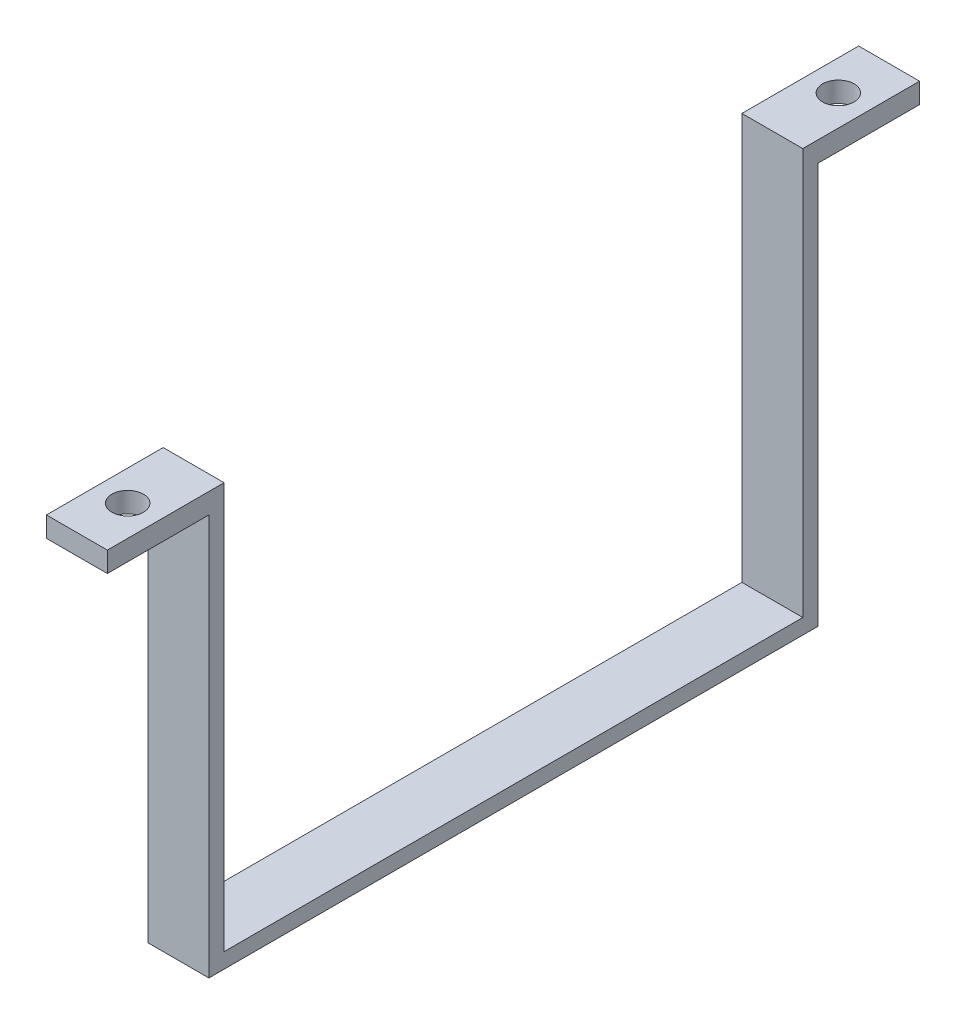
ISO-10303-21;
HEADER;
FILE_DESCRIPTION(('STEP AP214'),'2;1');
FILE_NAME('part.step','',(''),(''),'','','');
FILE_SCHEMA(('AUTOMOTIVE_DESIGN { 1 0 10303 214 1 1 1 1 }'));
ENDSEC;
DATA;
#1=APPLICATION_CONTEXT('core data for automotive mechanical design processes');
#2=APPLICATION_PROTOCOL_DEFINITION('international standard','automotive_design',2000,#1);
#3=PRODUCT_CONTEXT('',#1,'mechanical');
#4=PRODUCT('Part','Part','',(#3));
#5=PRODUCT_RELATED_PRODUCT_CATEGORY('part','',(#4));
#6=PRODUCT_DEFINITION_FORMATION('','',#4);
#7=PRODUCT_DEFINITION_CONTEXT('part definition',#1,'design');
#8=PRODUCT_DEFINITION('design','',#6,#7);
#9=PRODUCT_DEFINITION_SHAPE('','',#8);
#10=(LENGTH_UNIT() NAMED_UNIT(*) SI_UNIT(.MILLI.,.METRE.));
#11=(NAMED_UNIT(*) PLANE_ANGLE_UNIT() SI_UNIT($,.RADIAN.));
#12=(NAMED_UNIT(*) SI_UNIT($,.STERADIAN.) SOLID_ANGLE_UNIT());
#13=UNCERTAINTY_MEASURE_WITH_UNIT(LENGTH_MEASURE(1.E-05),#10,'distance_accuracy_value','');
#14=(GEOMETRIC_REPRESENTATION_CONTEXT(3) GLOBAL_UNCERTAINTY_ASSIGNED_CONTEXT((#13)) GLOBAL_UNIT_ASSIGNED_CONTEXT((#10,
#11,#12)) REPRESENTATION_CONTEXT('',''));
#15=CARTESIAN_POINT('',(0.,0.,0.));
#16=DIRECTION('',(0.,0.,1.));
#17=DIRECTION('',(1.,0.,0.));
#18=AXIS2_PLACEMENT_3D('',#15,#16,#17);
#19=CARTESIAN_POINT('',(0.,40.,-30.));
#20=DIRECTION('',(0.,0.,-1.));
#21=DIRECTION('',(-1.,0.,0.));
#22=AXIS2_PLACEMENT_3D('',#19,#20,#21);
#23=PLANE('',#22);
#24=DIRECTION('',(1.,0.,0.));
#25=VECTOR('',#24,1.);
#26=CARTESIAN_POINT('',(-25.,38.,-30.));
#27=LINE('',#26,#25);
#28=CARTESIAN_POINT('',(-23.,38.,-30.));
#29=VERTEX_POINT('',#28);
#30=CARTESIAN_POINT('',(-17.,38.,-30.));
#31=VERTEX_POINT('',#30);
#32=EDGE_CURVE('E154',#29,#31,#27,.T.);
#33=ORIENTED_EDGE('',*,*,#32,.T.);
#34=DIRECTION('',(0.,-1.,0.));
#35=VECTOR('',#34,1.);
#36=CARTESIAN_POINT('',(-17.,40.,-30.));
#37=LINE('',#36,#35);
#38=CARTESIAN_POINT('',(-17.,-1.5,-30.));
#39=VERTEX_POINT('',#38);
#40=EDGE_CURVE('E64',#31,#39,#37,.T.);
#41=ORIENTED_EDGE('',*,*,#40,.T.);
#42=DIRECTION('',(1.,0.,0.));
#43=VECTOR('',#42,1.);
#44=CARTESIAN_POINT('',(-25.,-1.5,-30.));
#45=LINE('',#44,#43);
#46=CARTESIAN_POINT('',(-23.,-1.5,-30.));
#47=VERTEX_POINT('',#46);
#48=EDGE_CURVE('E168',#47,#39,#45,.T.);
#49=ORIENTED_EDGE('',*,*,#48,.F.);
#50=DIRECTION('',(0.,1.,0.));
#51=VECTOR('',#50,1.);
#52=CARTESIAN_POINT('',(-23.,40.,-30.));
#53=LINE('',#52,#51);
#54=EDGE_CURVE('E256',#47,#29,#53,.T.);
#55=ORIENTED_EDGE('',*,*,#54,.T.);
#56=EDGE_LOOP('',(#33,#41,#49,#55));
#57=FACE_BOUND('',#56,.T.);
#58=ADVANCED_FACE('F48',(#57),#23,.T.);
#59=CARTESIAN_POINT('',(0.,40.,30.));
#60=DIRECTION('',(0.,0.,-1.));
#61=DIRECTION('',(-1.,0.,0.));
#62=AXIS2_PLACEMENT_3D('',#59,#60,#61);
#63=PLANE('',#62);
#64=DIRECTION('',(0.,-1.,0.));
#65=VECTOR('',#64,1.);
#66=CARTESIAN_POINT('',(-17.,40.,30.));
#67=LINE('',#66,#65);
#68=CARTESIAN_POINT('',(-17.,38.,30.));
#69=VERTEX_POINT('',#68);
#70=CARTESIAN_POINT('',(-17.,-1.5,30.));
#71=VERTEX_POINT('',#70);
#72=EDGE_CURVE('E229',#69,#71,#67,.T.);
#73=ORIENTED_EDGE('',*,*,#72,.F.);
#74=DIRECTION('',(1.,0.,0.));
#75=VECTOR('',#74,1.);
#76=CARTESIAN_POINT('',(-25.,38.,30.));
#77=LINE('',#76,#75);
#78=CARTESIAN_POINT('',(-23.,38.,30.));
#79=VERTEX_POINT('',#78);
#80=EDGE_CURVE('E164',#79,#69,#77,.T.);
#81=ORIENTED_EDGE('',*,*,#80,.F.);
#82=DIRECTION('',(0.,1.,0.));
#83=VECTOR('',#82,1.);
#84=CARTESIAN_POINT('',(-23.,40.,30.));
#85=LINE('',#84,#83);
#86=CARTESIAN_POINT('',(-23.,-1.5,30.));
#87=VERTEX_POINT('',#86);
#88=EDGE_CURVE('E228',#87,#79,#85,.T.);
#89=ORIENTED_EDGE('',*,*,#88,.F.);
#90=DIRECTION('',(-1.,0.,0.));
#91=VECTOR('',#90,1.);
#92=CARTESIAN_POINT('',(-25.,-1.5,30.));
#93=LINE('',#92,#91);
#94=EDGE_CURVE('E179',#71,#87,#93,.T.);
#95=ORIENTED_EDGE('',*,*,#94,.F.);
#96=EDGE_LOOP('',(#73,#81,#89,#95));
#97=FACE_BOUND('',#96,.T.);
#98=ADVANCED_FACE('F226',(#97),#63,.F.);
#99=CARTESIAN_POINT('',(0.,40.,28.5));
#100=DIRECTION('',(0.,0.,-1.));
#101=DIRECTION('',(-1.,0.,0.));
#102=AXIS2_PLACEMENT_3D('',#99,#100,#101);
#103=PLANE('',#102);
#104=DIRECTION('',(1.,0.,0.));
#105=VECTOR('',#104,1.);
#106=CARTESIAN_POINT('',(0.,40.,28.5));
#107=LINE('',#106,#105);
#108=CARTESIAN_POINT('',(-23.,40.,28.5));
#109=VERTEX_POINT('',#108);
#110=CARTESIAN_POINT('',(-17.,40.,28.5));
#111=VERTEX_POINT('',#110);
#112=EDGE_CURVE('E183',#109,#111,#107,.T.);
#113=ORIENTED_EDGE('',*,*,#112,.T.);
#114=DIRECTION('',(0.,-1.,0.));
#115=VECTOR('',#114,1.);
#116=CARTESIAN_POINT('',(-17.,40.,28.5));
#117=LINE('',#116,#115);
#118=CARTESIAN_POINT('',(-17.,0.,28.5));
#119=VERTEX_POINT('',#118);
#120=EDGE_CURVE('E232',#111,#119,#117,.T.);
#121=ORIENTED_EDGE('',*,*,#120,.T.);
#122=DIRECTION('',(1.,0.,0.));
#123=VECTOR('',#122,1.);
#124=CARTESIAN_POINT('',(0.,0.,28.5));
#125=LINE('',#124,#123);
#126=CARTESIAN_POINT('',(-23.,0.,28.5));
#127=VERTEX_POINT('',#126);
#128=EDGE_CURVE('E182',#127,#119,#125,.T.);
#129=ORIENTED_EDGE('',*,*,#128,.F.);
#130=DIRECTION('',(0.,1.,0.));
#131=VECTOR('',#130,1.);
#132=CARTESIAN_POINT('',(-23.,40.,28.5));
#133=LINE('',#132,#131);
#134=EDGE_CURVE('E274',#127,#109,#133,.T.);
#135=ORIENTED_EDGE('',*,*,#134,.T.);
#136=EDGE_LOOP('',(#113,#121,#129,#135));
#137=FACE_BOUND('',#136,.T.);
#138=ADVANCED_FACE('F50',(#137),#103,.T.);
#139=CARTESIAN_POINT('',(0.,40.,-28.5));
#140=DIRECTION('',(0.,0.,-1.));
#141=DIRECTION('',(-1.,0.,0.));
#142=AXIS2_PLACEMENT_3D('',#139,#140,#141);
#143=PLANE('',#142);
#144=DIRECTION('',(0.,-1.,0.));
#145=VECTOR('',#144,1.);
#146=CARTESIAN_POINT('',(-17.,40.,-28.5));
#147=LINE('',#146,#145);
#148=CARTESIAN_POINT('',(-17.,40.,-28.5));
#149=VERTEX_POINT('',#148);
#150=CARTESIAN_POINT('',(-17.,0.,-28.5));
#151=VERTEX_POINT('',#150);
#152=EDGE_CURVE('E300',#149,#151,#147,.T.);
#153=ORIENTED_EDGE('',*,*,#152,.F.);
#154=DIRECTION('',(1.,0.,0.));
#155=VECTOR('',#154,1.);
#156=CARTESIAN_POINT('',(0.,40.,-28.5));
#157=LINE('',#156,#155);
#158=CARTESIAN_POINT('',(-23.,40.,-28.5));
#159=VERTEX_POINT('',#158);
#160=EDGE_CURVE('E187',#159,#149,#157,.T.);
#161=ORIENTED_EDGE('',*,*,#160,.F.);
#162=DIRECTION('',(0.,1.,0.));
#163=VECTOR('',#162,1.);
#164=CARTESIAN_POINT('',(-23.,40.,-28.5));
#165=LINE('',#164,#163);
#166=CARTESIAN_POINT('',(-23.,0.,-28.5));
#167=VERTEX_POINT('',#166);
#168=EDGE_CURVE('E271',#167,#159,#165,.T.);
#169=ORIENTED_EDGE('',*,*,#168,.F.);
#170=DIRECTION('',(1.,0.,0.));
#171=VECTOR('',#170,1.);
#172=CARTESIAN_POINT('',(0.,0.,-28.5));
#173=LINE('',#172,#171);
#174=EDGE_CURVE('E188',#167,#151,#173,.T.);
#175=ORIENTED_EDGE('',*,*,#174,.T.);
#176=EDGE_LOOP('',(#153,#161,#169,#175));
#177=FACE_BOUND('',#176,.T.);
#178=ADVANCED_FACE('F298',(#177),#143,.F.);
#179=CARTESIAN_POINT('',(0.,40.,0.));
#180=DIRECTION('',(0.,1.,0.));
#181=DIRECTION('',(0.,0.,1.));
#182=AXIS2_PLACEMENT_3D('',#179,#180,#181);
#183=PLANE('',#182);
#184=CARTESIAN_POINT('',(-20.,40.,35.));
#185=DIRECTION('',(0.,1.,0.));
#186=DIRECTION('',(0.,0.,1.));
#187=AXIS2_PLACEMENT_3D('',#184,#185,#186);
#188=CIRCLE('',#187,1.55);
#189=CARTESIAN_POINT('',(-20.,40.,36.55));
#190=VERTEX_POINT('',#189);
#191=EDGE_CURVE('E278',#190,#190,#188,.T.);
#192=ORIENTED_EDGE('',*,*,#191,.F.);
#193=EDGE_LOOP('',(#192));
#194=FACE_BOUND('',#193,.T.);
#195=DIRECTION('',(1.,0.,0.));
#196=VECTOR('',#195,1.);
#197=CARTESIAN_POINT('',(-25.,40.,40.));
#198=LINE('',#197,#196);
#199=CARTESIAN_POINT('',(-23.,40.,40.));
#200=VERTEX_POINT('',#199);
#201=CARTESIAN_POINT('',(-17.,40.,40.));
#202=VERTEX_POINT('',#201);
#203=EDGE_CURVE('E158',#200,#202,#198,.T.);
#204=ORIENTED_EDGE('',*,*,#203,.T.);
#205=DIRECTION('',(0.,0.,-1.));
#206=VECTOR('',#205,1.);
#207=CARTESIAN_POINT('',(-17.,40.,0.));
#208=LINE('',#207,#206);
#209=EDGE_CURVE('E236',#202,#111,#208,.T.);
#210=ORIENTED_EDGE('',*,*,#209,.T.);
#211=ORIENTED_EDGE('',*,*,#112,.F.);
#212=DIRECTION('',(0.,0.,-1.));
#213=VECTOR('',#212,1.);
#214=CARTESIAN_POINT('',(-23.,40.,-40.));
#215=LINE('',#214,#213);
#216=EDGE_CURVE('E253',#200,#109,#215,.T.);
#217=ORIENTED_EDGE('',*,*,#216,.F.);
#218=EDGE_LOOP('',(#204,#210,#211,#217));
#219=FACE_BOUND('',#218,.T.);
#220=ADVANCED_FACE('F291',(#194,#219),#183,.T.);
#221=CARTESIAN_POINT('',(-20.,40.,-35.));
#222=DIRECTION('',(0.,1.,0.));
#223=DIRECTION('',(0.,0.,1.));
#224=AXIS2_PLACEMENT_3D('',#221,#222,#223);
#225=CIRCLE('',#224,1.55);
#226=CARTESIAN_POINT('',(-20.,40.,-33.45));
#227=VERTEX_POINT('',#226);
#228=EDGE_CURVE('E202',#227,#227,#225,.T.);
#229=ORIENTED_EDGE('',*,*,#228,.F.);
#230=EDGE_LOOP('',(#229));
#231=FACE_BOUND('',#230,.T.);
#232=ORIENTED_EDGE('',*,*,#160,.T.);
#233=CARTESIAN_POINT('',(-17.,40.,-40.));
#234=VERTEX_POINT('',#233);
#235=EDGE_CURVE('E150',#149,#234,#208,.T.);
#236=ORIENTED_EDGE('',*,*,#235,.T.);
#237=DIRECTION('',(1.,0.,0.));
#238=VECTOR('',#237,1.);
#239=CARTESIAN_POINT('',(-25.,40.,-40.));
#240=LINE('',#239,#238);
#241=CARTESIAN_POINT('',(-23.,40.,-40.));
#242=VERTEX_POINT('',#241);
#243=EDGE_CURVE('E148',#242,#234,#240,.T.);
#244=ORIENTED_EDGE('',*,*,#243,.F.);
#245=EDGE_CURVE('E252',#159,#242,#215,.T.);
#246=ORIENTED_EDGE('',*,*,#245,.F.);
#247=EDGE_LOOP('',(#232,#236,#244,#246));
#248=FACE_BOUND('',#247,.T.);
#249=ADVANCED_FACE('F287',(#231,#248),#183,.T.);
#250=CARTESIAN_POINT('',(0.,0.,0.));
#251=DIRECTION('',(0.,-1.,0.));
#252=DIRECTION('',(0.,0.,-1.));
#253=AXIS2_PLACEMENT_3D('',#250,#251,#252);
#254=PLANE('',#253);
#255=DIRECTION('',(0.,0.,1.));
#256=VECTOR('',#255,1.);
#257=CARTESIAN_POINT('',(-17.,0.,0.));
#258=LINE('',#257,#256);
#259=EDGE_CURVE('E239',#151,#119,#258,.T.);
#260=ORIENTED_EDGE('',*,*,#259,.F.);
#261=ORIENTED_EDGE('',*,*,#174,.F.);
#262=DIRECTION('',(0.,0.,-1.));
#263=VECTOR('',#262,1.);
#264=CARTESIAN_POINT('',(-23.,0.,0.));
#265=LINE('',#264,#263);
#266=EDGE_CURVE('E268',#127,#167,#265,.T.);
#267=ORIENTED_EDGE('',*,*,#266,.F.);
#268=ORIENTED_EDGE('',*,*,#128,.T.);
#269=EDGE_LOOP('',(#260,#261,#267,#268));
#270=FACE_BOUND('',#269,.T.);
#271=ADVANCED_FACE('F290',(#270),#254,.F.);
#272=CARTESIAN_POINT('',(0.,-1.5,0.));
#273=DIRECTION('',(0.,-1.,0.));
#274=DIRECTION('',(0.,0.,-1.));
#275=AXIS2_PLACEMENT_3D('',#272,#273,#274);
#276=PLANE('',#275);
#277=ORIENTED_EDGE('',*,*,#48,.T.);
#278=DIRECTION('',(0.,0.,1.));
#279=VECTOR('',#278,1.);
#280=CARTESIAN_POINT('',(-17.,-1.5,0.));
#281=LINE('',#280,#279);
#282=EDGE_CURVE('E306',#39,#71,#281,.T.);
#283=ORIENTED_EDGE('',*,*,#282,.T.);
#284=ORIENTED_EDGE('',*,*,#94,.T.);
#285=DIRECTION('',(0.,0.,-1.));
#286=VECTOR('',#285,1.);
#287=CARTESIAN_POINT('',(-23.,-1.5,0.));
#288=LINE('',#287,#286);
#289=EDGE_CURVE('E260',#87,#47,#288,.T.);
#290=ORIENTED_EDGE('',*,*,#289,.T.);
#291=EDGE_LOOP('',(#277,#283,#284,#290));
#292=FACE_BOUND('',#291,.T.);
#293=ADVANCED_FACE('F215',(#292),#276,.T.);
#294=CARTESIAN_POINT('',(-25.,38.,30.));
#295=DIRECTION('',(0.,-1.,0.));
#296=DIRECTION('',(0.,0.,-1.));
#297=AXIS2_PLACEMENT_3D('',#294,#295,#296);
#298=PLANE('',#297);
#299=CARTESIAN_POINT('',(-20.,38.,35.));
#300=DIRECTION('',(0.,-1.,0.));
#301=DIRECTION('',(0.,0.,-1.));
#302=AXIS2_PLACEMENT_3D('',#299,#300,#301);
#303=CIRCLE('',#302,1.55);
#304=CARTESIAN_POINT('',(-20.,38.,33.45));
#305=VERTEX_POINT('',#304);
#306=EDGE_CURVE('E160',#305,#305,#303,.T.);
#307=ORIENTED_EDGE('',*,*,#306,.F.);
#308=EDGE_LOOP('',(#307));
#309=FACE_BOUND('',#308,.T.);
#310=ORIENTED_EDGE('',*,*,#80,.T.);
#311=DIRECTION('',(0.,0.,1.));
#312=VECTOR('',#311,1.);
#313=CARTESIAN_POINT('',(-17.,38.,30.));
#314=LINE('',#313,#312);
#315=CARTESIAN_POINT('',(-17.,38.,40.));
#316=VERTEX_POINT('',#315);
#317=EDGE_CURVE('E221',#69,#316,#314,.T.);
#318=ORIENTED_EDGE('',*,*,#317,.T.);
#319=DIRECTION('',(1.,0.,0.));
#320=VECTOR('',#319,1.);
#321=CARTESIAN_POINT('',(-25.,38.,40.));
#322=LINE('',#321,#320);
#323=CARTESIAN_POINT('',(-23.,38.,40.));
#324=VERTEX_POINT('',#323);
#325=EDGE_CURVE('E169',#324,#316,#322,.T.);
#326=ORIENTED_EDGE('',*,*,#325,.F.);
#327=DIRECTION('',(0.,0.,-1.));
#328=VECTOR('',#327,1.);
#329=CARTESIAN_POINT('',(-23.,38.,30.));
#330=LINE('',#329,#328);
#331=EDGE_CURVE('E222',#324,#79,#330,.T.);
#332=ORIENTED_EDGE('',*,*,#331,.T.);
#333=EDGE_LOOP('',(#310,#318,#326,#332));
#334=FACE_BOUND('',#333,.T.);
#335=ADVANCED_FACE('F211',(#309,#334),#298,.T.);
#336=CARTESIAN_POINT('',(-25.,40.,40.));
#337=DIRECTION('',(0.,0.,1.));
#338=DIRECTION('',(1.,0.,0.));
#339=AXIS2_PLACEMENT_3D('',#336,#337,#338);
#340=PLANE('',#339);
#341=ORIENTED_EDGE('',*,*,#325,.T.);
#342=DIRECTION('',(0.,1.,0.));
#343=VECTOR('',#342,1.);
#344=CARTESIAN_POINT('',(-17.,40.,40.));
#345=LINE('',#344,#343);
#346=EDGE_CURVE('E243',#316,#202,#345,.T.);
#347=ORIENTED_EDGE('',*,*,#346,.T.);
#348=ORIENTED_EDGE('',*,*,#203,.F.);
#349=DIRECTION('',(0.,1.,0.));
#350=VECTOR('',#349,1.);
#351=CARTESIAN_POINT('',(-23.,40.,40.));
#352=LINE('',#351,#350);
#353=EDGE_CURVE('E249',#324,#200,#352,.T.);
#354=ORIENTED_EDGE('',*,*,#353,.F.);
#355=EDGE_LOOP('',(#341,#347,#348,#354));
#356=FACE_BOUND('',#355,.T.);
#357=ADVANCED_FACE('F214',(#356),#340,.T.);
#358=CARTESIAN_POINT('',(-25.,40.,-40.));
#359=DIRECTION('',(0.,0.,-1.));
#360=DIRECTION('',(-1.,0.,0.));
#361=AXIS2_PLACEMENT_3D('',#358,#359,#360);
#362=PLANE('',#361);
#363=ORIENTED_EDGE('',*,*,#243,.T.);
#364=DIRECTION('',(0.,-1.,0.));
#365=VECTOR('',#364,1.);
#366=CARTESIAN_POINT('',(-17.,40.,-40.));
#367=LINE('',#366,#365);
#368=CARTESIAN_POINT('',(-17.,38.,-40.));
#369=VERTEX_POINT('',#368);
#370=EDGE_CURVE('E136',#234,#369,#367,.T.);
#371=ORIENTED_EDGE('',*,*,#370,.T.);
#372=DIRECTION('',(1.,0.,0.));
#373=VECTOR('',#372,1.);
#374=CARTESIAN_POINT('',(-25.,38.,-40.));
#375=LINE('',#374,#373);
#376=CARTESIAN_POINT('',(-23.,38.,-40.));
#377=VERTEX_POINT('',#376);
#378=EDGE_CURVE('E146',#377,#369,#375,.T.);
#379=ORIENTED_EDGE('',*,*,#378,.F.);
#380=DIRECTION('',(0.,-1.,0.));
#381=VECTOR('',#380,1.);
#382=CARTESIAN_POINT('',(-23.,40.,-40.));
#383=LINE('',#382,#381);
#384=EDGE_CURVE('E71',#242,#377,#383,.T.);
#385=ORIENTED_EDGE('',*,*,#384,.F.);
#386=EDGE_LOOP('',(#363,#371,#379,#385));
#387=FACE_BOUND('',#386,.T.);
#388=ADVANCED_FACE('F145',(#387),#362,.T.);
#389=CARTESIAN_POINT('',(-25.,38.,-30.));
#390=DIRECTION('',(0.,-1.,0.));
#391=DIRECTION('',(0.,0.,-1.));
#392=AXIS2_PLACEMENT_3D('',#389,#390,#391);
#393=PLANE('',#392);
#394=CARTESIAN_POINT('',(-20.,38.,-35.));
#395=DIRECTION('',(0.,-1.,0.));
#396=DIRECTION('',(0.,0.,-1.));
#397=AXIS2_PLACEMENT_3D('',#394,#395,#396);
#398=CIRCLE('',#397,1.55);
#399=CARTESIAN_POINT('',(-20.,38.,-36.55));
#400=VERTEX_POINT('',#399);
#401=EDGE_CURVE('E198',#400,#400,#398,.T.);
#402=ORIENTED_EDGE('',*,*,#401,.F.);
#403=EDGE_LOOP('',(#402));
#404=FACE_BOUND('',#403,.T.);
#405=ORIENTED_EDGE('',*,*,#378,.T.);
#406=DIRECTION('',(0.,0.,1.));
#407=VECTOR('',#406,1.);
#408=CARTESIAN_POINT('',(-17.,38.,-30.));
#409=LINE('',#408,#407);
#410=EDGE_CURVE('E11',#369,#31,#409,.T.);
#411=ORIENTED_EDGE('',*,*,#410,.T.);
#412=ORIENTED_EDGE('',*,*,#32,.F.);
#413=DIRECTION('',(0.,0.,-1.));
#414=VECTOR('',#413,1.);
#415=CARTESIAN_POINT('',(-23.,38.,-30.));
#416=LINE('',#415,#414);
#417=EDGE_CURVE('E57',#29,#377,#416,.T.);
#418=ORIENTED_EDGE('',*,*,#417,.T.);
#419=EDGE_LOOP('',(#405,#411,#412,#418));
#420=FACE_BOUND('',#419,.T.);
#421=ADVANCED_FACE('F152',(#404,#420),#393,.T.);
#422=CARTESIAN_POINT('',(-20.,37.,-35.));
#423=DIRECTION('',(0.,1.,0.));
#424=DIRECTION('',(0.,0.,1.));
#425=AXIS2_PLACEMENT_3D('',#422,#423,#424);
#426=CYLINDRICAL_SURFACE('',#425,1.55);
#427=ORIENTED_EDGE('',*,*,#401,.T.);
#428=EDGE_LOOP('',(#427));
#429=FACE_BOUND('',#428,.T.);
#430=ORIENTED_EDGE('',*,*,#228,.T.);
#431=EDGE_LOOP('',(#430));
#432=FACE_BOUND('',#431,.T.);
#433=ADVANCED_FACE('F285',(#429,#432),#426,.F.);
#434=CARTESIAN_POINT('',(-20.,37.,35.));
#435=DIRECTION('',(0.,1.,0.));
#436=DIRECTION('',(0.,0.,1.));
#437=AXIS2_PLACEMENT_3D('',#434,#435,#436);
#438=CYLINDRICAL_SURFACE('',#437,1.55);
#439=ORIENTED_EDGE('',*,*,#306,.T.);
#440=EDGE_LOOP('',(#439));
#441=FACE_BOUND('',#440,.T.);
#442=ORIENTED_EDGE('',*,*,#191,.T.);
#443=EDGE_LOOP('',(#442));
#444=FACE_BOUND('',#443,.T.);
#445=ADVANCED_FACE('F208',(#441,#444),#438,.F.);
#446=CARTESIAN_POINT('',(-23.,0.,0.));
#447=DIRECTION('',(-1.,0.,0.));
#448=DIRECTION('',(0.,0.,1.));
#449=AXIS2_PLACEMENT_3D('',#446,#447,#448);
#450=PLANE('',#449);
#451=ORIENTED_EDGE('',*,*,#266,.T.);
#452=ORIENTED_EDGE('',*,*,#168,.T.);
#453=ORIENTED_EDGE('',*,*,#245,.T.);
#454=ORIENTED_EDGE('',*,*,#384,.T.);
#455=ORIENTED_EDGE('',*,*,#417,.F.);
#456=ORIENTED_EDGE('',*,*,#54,.F.);
#457=ORIENTED_EDGE('',*,*,#289,.F.);
#458=ORIENTED_EDGE('',*,*,#88,.T.);
#459=ORIENTED_EDGE('',*,*,#331,.F.);
#460=ORIENTED_EDGE('',*,*,#353,.T.);
#461=ORIENTED_EDGE('',*,*,#216,.T.);
#462=ORIENTED_EDGE('',*,*,#134,.F.);
#463=EDGE_LOOP('',(#451,#452,#453,#454,#455,#456,#457,#458,#459,#460,#461,#462));
#464=FACE_BOUND('',#463,.T.);
#465=ADVANCED_FACE('F318',(#464),#450,.T.);
#466=CARTESIAN_POINT('',(-17.,0.,0.));
#467=DIRECTION('',(1.,0.,0.));
#468=DIRECTION('',(0.,0.,-1.));
#469=AXIS2_PLACEMENT_3D('',#466,#467,#468);
#470=PLANE('',#469);
#471=ORIENTED_EDGE('',*,*,#317,.F.);
#472=ORIENTED_EDGE('',*,*,#72,.T.);
#473=ORIENTED_EDGE('',*,*,#282,.F.);
#474=ORIENTED_EDGE('',*,*,#40,.F.);
#475=ORIENTED_EDGE('',*,*,#410,.F.);
#476=ORIENTED_EDGE('',*,*,#370,.F.);
#477=ORIENTED_EDGE('',*,*,#235,.F.);
#478=ORIENTED_EDGE('',*,*,#152,.T.);
#479=ORIENTED_EDGE('',*,*,#259,.T.);
#480=ORIENTED_EDGE('',*,*,#120,.F.);
#481=ORIENTED_EDGE('',*,*,#209,.F.);
#482=ORIENTED_EDGE('',*,*,#346,.F.);
#483=EDGE_LOOP('',(#471,#472,#473,#474,#475,#476,#477,#478,#479,#480,#481,#482));
#484=FACE_BOUND('',#483,.T.);
#485=ADVANCED_FACE('F135',(#484),#470,.T.);
#486=CLOSED_SHELL('',(#58,#98,#138,#178,#220,#249,#271,#293,#335,#357,#388,#421,#433,#445,#465,#485));
#487=MANIFOLD_SOLID_BREP('B2',#486);
#488=ADVANCED_BREP_SHAPE_REPRESENTATION('',(#18,#487),#14);
#489=SHAPE_DEFINITION_REPRESENTATION(#9,#488);
ENDSEC;
END-ISO-10303-21;
